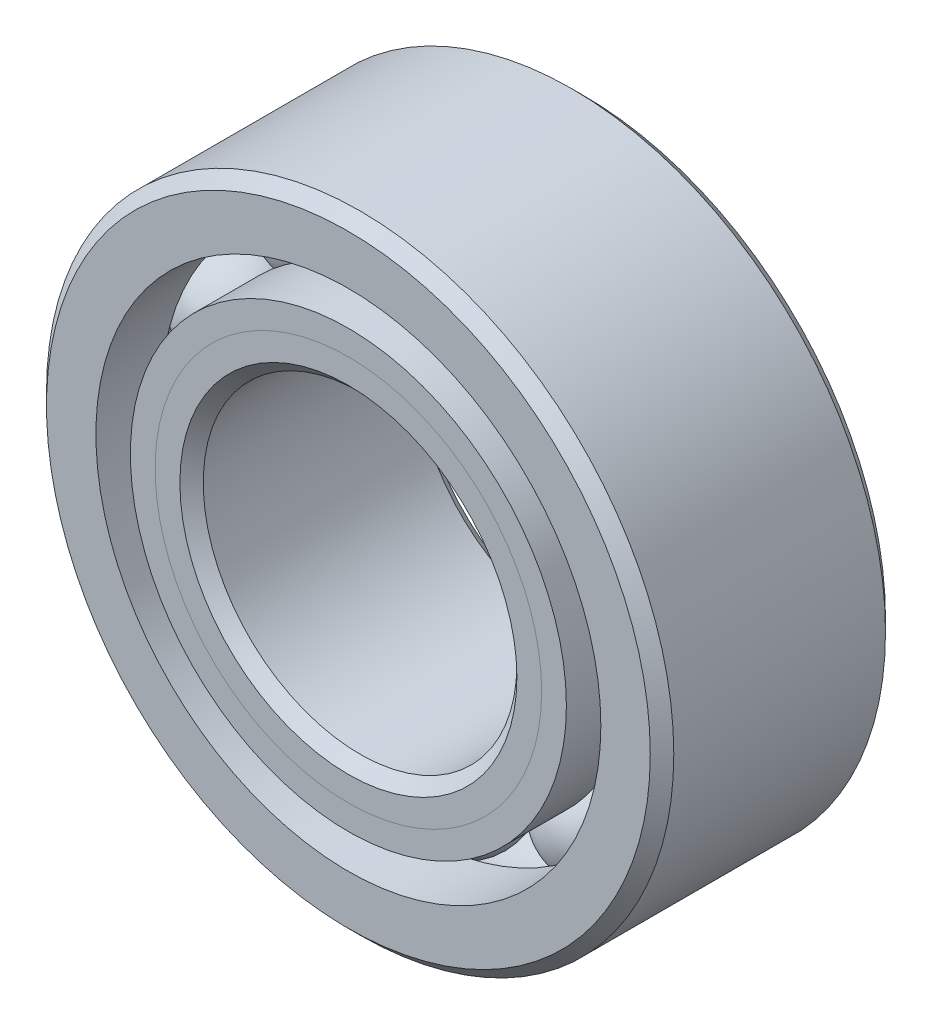
ISO-10303-21;
HEADER;
FILE_DESCRIPTION(('STEP AP214'),'2;1');
FILE_NAME('part.step','',(''),(''),'','','');
FILE_SCHEMA(('AUTOMOTIVE_DESIGN { 1 0 10303 214 1 1 1 1 }'));
ENDSEC;
DATA;
#1=APPLICATION_CONTEXT('core data for automotive mechanical design processes');
#2=APPLICATION_PROTOCOL_DEFINITION('international standard','automotive_design',2000,#1);
#3=PRODUCT_CONTEXT('',#1,'mechanical');
#4=PRODUCT('Part','Part','',(#3));
#5=PRODUCT_RELATED_PRODUCT_CATEGORY('part','',(#4));
#6=PRODUCT_DEFINITION_FORMATION('','',#4);
#7=PRODUCT_DEFINITION_CONTEXT('part definition',#1,'design');
#8=PRODUCT_DEFINITION('design','',#6,#7);
#9=PRODUCT_DEFINITION_SHAPE('','',#8);
#10=(LENGTH_UNIT() NAMED_UNIT(*) SI_UNIT(.MILLI.,.METRE.));
#11=(NAMED_UNIT(*) PLANE_ANGLE_UNIT() SI_UNIT($,.RADIAN.));
#12=(NAMED_UNIT(*) SI_UNIT($,.STERADIAN.) SOLID_ANGLE_UNIT());
#13=UNCERTAINTY_MEASURE_WITH_UNIT(LENGTH_MEASURE(1.E-05),#10,'distance_accuracy_value','');
#14=(GEOMETRIC_REPRESENTATION_CONTEXT(3) GLOBAL_UNCERTAINTY_ASSIGNED_CONTEXT((#13)) GLOBAL_UNIT_ASSIGNED_CONTEXT((#10,
#11,#12)) REPRESENTATION_CONTEXT('',''));
#15=CARTESIAN_POINT('',(0.,0.,0.));
#16=DIRECTION('',(0.,0.,1.));
#17=DIRECTION('',(1.,0.,0.));
#18=AXIS2_PLACEMENT_3D('',#15,#16,#17);
#19=CARTESIAN_POINT('',(-1.39966363202143,1.92647171785536,0.));
#20=DIRECTION('',(0.,0.,1.));
#21=DIRECTION('',(-0.587785252292462,0.809016994374955,0.));
#22=AXIS2_PLACEMENT_3D('',#19,#20,#21);
#23=SPHERICAL_SURFACE('',#22,0.557180720515983);
#24=CARTESIAN_POINT('',(-1.39966363202143,1.92647171785536,0.557180720515982));
#25=VERTEX_POINT('',#24);
#26=VERTEX_LOOP('',#25);
#27=FACE_BOUND('',#26,.T.);
#28=ADVANCED_FACE('F48',(#27),#23,.T.);
#29=CLOSED_SHELL('',(#28));
#30=MANIFOLD_SOLID_BREP('B2',#29);
#31=CARTESIAN_POINT('',(-2.26470332942783,0.735846717855369,0.));
#32=DIRECTION('',(0.,0.,1.));
#33=DIRECTION('',(-0.95105651629515,0.309016994374958,0.));
#34=AXIS2_PLACEMENT_3D('',#31,#32,#33);
#35=SPHERICAL_SURFACE('',#34,0.557180720515983);
#36=CARTESIAN_POINT('',(-2.26470332942783,0.735846717855369,0.557180720515982));
#37=VERTEX_POINT('',#36);
#38=VERTEX_LOOP('',#37);
#39=FACE_BOUND('',#38,.T.);
#40=ADVANCED_FACE('F87',(#39),#35,.T.);
#41=CLOSED_SHELL('',(#40));
#42=MANIFOLD_SOLID_BREP('B6',#41);
#43=CARTESIAN_POINT('',(-2.26470332942784,-0.735846717855322,0.));
#44=DIRECTION('',(0.,0.,1.));
#45=DIRECTION('',(-0.951056516295157,-0.309016994374938,0.));
#46=AXIS2_PLACEMENT_3D('',#43,#44,#45);
#47=SPHERICAL_SURFACE('',#46,0.557180720515983);
#48=CARTESIAN_POINT('',(-2.26470332942784,-0.735846717855322,0.557180720515982));
#49=VERTEX_POINT('',#48);
#50=VERTEX_LOOP('',#49);
#51=FACE_BOUND('',#50,.T.);
#52=ADVANCED_FACE('F126',(#51),#47,.T.);
#53=CLOSED_SHELL('',(#52));
#54=MANIFOLD_SOLID_BREP('B44',#53);
#55=CARTESIAN_POINT('',(-1.39966363202147,-1.92647171785533,0.));
#56=DIRECTION('',(0.,0.,1.));
#57=DIRECTION('',(-0.58778525229248,-0.809016994374942,0.));
#58=AXIS2_PLACEMENT_3D('',#55,#56,#57);
#59=SPHERICAL_SURFACE('',#58,0.557180720515983);
#60=CARTESIAN_POINT('',(-1.39966363202147,-1.92647171785533,0.557180720515982));
#61=VERTEX_POINT('',#60);
#62=VERTEX_LOOP('',#61);
#63=FACE_BOUND('',#62,.T.);
#64=ADVANCED_FACE('F165',(#63),#59,.T.);
#65=CLOSED_SHELL('',(#64));
#66=MANIFOLD_SOLID_BREP('B83',#65);
#67=CARTESIAN_POINT('',(0.,-2.38125,0.));
#68=DIRECTION('',(0.,0.,1.));
#69=DIRECTION('',(0.,-1.,0.));
#70=AXIS2_PLACEMENT_3D('',#67,#68,#69);
#71=SPHERICAL_SURFACE('',#70,0.557180720515983);
#72=CARTESIAN_POINT('',(0.,-2.38125,0.557180720515982));
#73=VERTEX_POINT('',#72);
#74=VERTEX_LOOP('',#73);
#75=FACE_BOUND('',#74,.T.);
#76=ADVANCED_FACE('F206',(#75),#71,.T.);
#77=CLOSED_SHELL('',(#76));
#78=MANIFOLD_SOLID_BREP('B122',#77);
#79=CARTESIAN_POINT('',(1.39966363202144,-1.92647171785535,0.));
#80=DIRECTION('',(0.,0.,1.));
#81=DIRECTION('',(0.587785252292469,-0.809016994374951,0.));
#82=AXIS2_PLACEMENT_3D('',#79,#80,#81);
#83=SPHERICAL_SURFACE('',#82,0.557180720515983);
#84=CARTESIAN_POINT('',(1.39966363202144,-1.92647171785535,0.557180720515982));
#85=VERTEX_POINT('',#84);
#86=VERTEX_LOOP('',#85);
#87=FACE_BOUND('',#86,.T.);
#88=ADVANCED_FACE('F247',(#87),#83,.T.);
#89=CLOSED_SHELL('',(#88));
#90=MANIFOLD_SOLID_BREP('B161',#89);
#91=CARTESIAN_POINT('',(2.26470332942783,-0.735846717855353,0.));
#92=DIRECTION('',(0.,0.,1.));
#93=DIRECTION('',(0.951056516295152,-0.309016994374952,0.));
#94=AXIS2_PLACEMENT_3D('',#91,#92,#93);
#95=SPHERICAL_SURFACE('',#94,0.557180720515983);
#96=CARTESIAN_POINT('',(2.26470332942783,-0.735846717855353,0.557180720515982));
#97=VERTEX_POINT('',#96);
#98=VERTEX_LOOP('',#97);
#99=FACE_BOUND('',#98,.T.);
#100=ADVANCED_FACE('F286',(#99),#95,.T.);
#101=CLOSED_SHELL('',(#100));
#102=MANIFOLD_SOLID_BREP('B202',#101);
#103=CARTESIAN_POINT('',(2.26470332942784,0.735846717855337,0.));
#104=DIRECTION('',(0.,0.,1.));
#105=DIRECTION('',(0.951056516295155,0.309016994374945,0.));
#106=AXIS2_PLACEMENT_3D('',#103,#104,#105);
#107=SPHERICAL_SURFACE('',#106,0.557180720515983);
#108=CARTESIAN_POINT('',(2.26470332942784,0.735846717855337,0.557180720515982));
#109=VERTEX_POINT('',#108);
#110=VERTEX_LOOP('',#109);
#111=FACE_BOUND('',#110,.T.);
#112=ADVANCED_FACE('F325',(#111),#107,.T.);
#113=CLOSED_SHELL('',(#112));
#114=MANIFOLD_SOLID_BREP('B243',#113);
#115=CARTESIAN_POINT('',(1.39966363202145,1.92647171785534,0.));
#116=DIRECTION('',(0.,0.,1.));
#117=DIRECTION('',(0.587785252292474,0.809016994374947,0.));
#118=AXIS2_PLACEMENT_3D('',#115,#116,#117);
#119=SPHERICAL_SURFACE('',#118,0.557180720515983);
#120=CARTESIAN_POINT('',(1.39966363202145,1.92647171785534,0.557180720515982));
#121=VERTEX_POINT('',#120);
#122=VERTEX_LOOP('',#121);
#123=FACE_BOUND('',#122,.T.);
#124=ADVANCED_FACE('F366',(#123),#119,.T.);
#125=CLOSED_SHELL('',(#124));
#126=MANIFOLD_SOLID_BREP('B282',#125);
#127=CARTESIAN_POINT('',(0.,2.38125,0.));
#128=DIRECTION('',(0.,0.,1.));
#129=DIRECTION('',(0.,1.,0.));
#130=AXIS2_PLACEMENT_3D('',#127,#128,#129);
#131=SPHERICAL_SURFACE('',#130,0.557180720515983);
#132=CARTESIAN_POINT('',(0.,2.38125,0.557180720515982));
#133=VERTEX_POINT('',#132);
#134=VERTEX_LOOP('',#133);
#135=FACE_BOUND('',#134,.T.);
#136=ADVANCED_FACE('F409',(#135),#131,.T.);
#137=CLOSED_SHELL('',(#136));
#138=MANIFOLD_SOLID_BREP('B321',#137);
#139=CARTESIAN_POINT('',(0.,1.95629204514573,1.190625));
#140=DIRECTION('',(0.,0.,-1.));
#141=DIRECTION('',(-1.,0.,0.));
#142=AXIS2_PLACEMENT_3D('',#139,#140,#141);
#143=PLANE('',#142);
#144=CARTESIAN_POINT('',(0.,0.,1.190625));
#145=DIRECTION('',(0.,0.,1.));
#146=DIRECTION('',(1.,0.,0.));
#147=AXIS2_PLACEMENT_3D('',#144,#145,#146);
#148=CIRCLE('',#147,1.70578463974201);
#149=CARTESIAN_POINT('',(1.70578463974201,0.,1.190625));
#150=VERTEX_POINT('',#149);
#151=EDGE_CURVE('E464',#150,#150,#148,.T.);
#152=ORIENTED_EDGE('',*,*,#151,.F.);
#153=EDGE_LOOP('',(#152));
#154=FACE_BOUND('',#153,.T.);
#155=CARTESIAN_POINT('',(0.,0.,1.190625));
#156=DIRECTION('',(0.,0.,1.));
#157=DIRECTION('',(1.,0.,0.));
#158=AXIS2_PLACEMENT_3D('',#155,#156,#157);
#159=CIRCLE('',#158,1.95629204514573);
#160=CARTESIAN_POINT('',(1.95629204514573,0.,1.190625));
#161=VERTEX_POINT('',#160);
#162=EDGE_CURVE('E408',#161,#161,#159,.T.);
#163=ORIENTED_EDGE('',*,*,#162,.T.);
#164=EDGE_LOOP('',(#163));
#165=FACE_BOUND('',#164,.T.);
#166=ADVANCED_FACE('F430',(#154,#165),#143,.F.);
#167=CARTESIAN_POINT('',(0.,0.,0.940117594596281));
#168=DIRECTION('',(0.,0.,1.));
#169=DIRECTION('',(1.,0.,0.));
#170=AXIS2_PLACEMENT_3D('',#167,#168,#169);
#171=CONICAL_SURFACE('',#170,1.70578463974201,0.78539816339745);
#172=ORIENTED_EDGE('',*,*,#162,.F.);
#173=EDGE_LOOP('',(#172));
#174=FACE_BOUND('',#173,.T.);
#175=CARTESIAN_POINT('',(0.,0.,0.940117594596281));
#176=DIRECTION('',(0.,0.,1.));
#177=DIRECTION('',(1.,0.,0.));
#178=AXIS2_PLACEMENT_3D('',#175,#176,#177);
#179=CIRCLE('',#178,1.70578463974201);
#180=CARTESIAN_POINT('',(1.70578463974201,0.,0.940117594596281));
#181=VERTEX_POINT('',#180);
#182=EDGE_CURVE('E436',#181,#181,#179,.T.);
#183=ORIENTED_EDGE('',*,*,#182,.T.);
#184=EDGE_LOOP('',(#183));
#185=FACE_BOUND('',#184,.T.);
#186=ADVANCED_FACE('F471',(#174,#185),#171,.T.);
#187=CARTESIAN_POINT('',(0.,0.,1.190625));
#188=DIRECTION('',(0.,0.,1.));
#189=DIRECTION('',(1.,0.,0.));
#190=AXIS2_PLACEMENT_3D('',#187,#188,#189);
#191=CYLINDRICAL_SURFACE('',#190,1.70578463974201);
#192=ORIENTED_EDGE('',*,*,#182,.F.);
#193=EDGE_LOOP('',(#192));
#194=FACE_BOUND('',#193,.T.);
#195=CARTESIAN_POINT('',(0.,0.,0.));
#196=DIRECTION('',(0.,0.,1.));
#197=DIRECTION('',(1.,0.,0.));
#198=AXIS2_PLACEMENT_3D('',#195,#196,#197);
#199=CIRCLE('',#198,1.70578463974201);
#200=CARTESIAN_POINT('',(1.70578463974201,0.,0.));
#201=VERTEX_POINT('',#200);
#202=EDGE_CURVE('E440',#201,#201,#199,.T.);
#203=ORIENTED_EDGE('',*,*,#202,.T.);
#204=EDGE_LOOP('',(#203));
#205=FACE_BOUND('',#204,.T.);
#206=ADVANCED_FACE('F475',(#194,#205),#191,.T.);
#207=CARTESIAN_POINT('',(0.,1.70578463974201,0.));
#208=DIRECTION('',(0.,0.,-1.));
#209=DIRECTION('',(-1.,0.,0.));
#210=AXIS2_PLACEMENT_3D('',#207,#208,#209);
#211=PLANE('',#210);
#212=ORIENTED_EDGE('',*,*,#202,.F.);
#213=EDGE_LOOP('',(#212));
#214=FACE_BOUND('',#213,.T.);
#215=CARTESIAN_POINT('',(0.,0.,0.));
#216=DIRECTION('',(0.,0.,1.));
#217=DIRECTION('',(1.,0.,0.));
#218=AXIS2_PLACEMENT_3D('',#215,#216,#217);
#219=CIRCLE('',#218,1.82406927948402);
#220=CARTESIAN_POINT('',(1.82406927948402,0.,0.));
#221=VERTEX_POINT('',#220);
#222=EDGE_CURVE('E444',#221,#221,#219,.T.);
#223=ORIENTED_EDGE('',*,*,#222,.T.);
#224=EDGE_LOOP('',(#223));
#225=FACE_BOUND('',#224,.T.);
#226=ADVANCED_FACE('F480',(#214,#225),#211,.F.);
#227=CARTESIAN_POINT('',(0.,0.,0.));
#228=DIRECTION('',(0.,0.,1.));
#229=DIRECTION('',(1.,0.,0.));
#230=AXIS2_PLACEMENT_3D('',#227,#228,#229);
#231=TOROIDAL_SURFACE('',#230,2.38125,0.557180720515982);
#232=ORIENTED_EDGE('',*,*,#222,.F.);
#233=EDGE_LOOP('',(#232));
#234=FACE_BOUND('',#233,.T.);
#235=CARTESIAN_POINT('',(0.,0.,-0.529166666666667));
#236=DIRECTION('',(0.,0.,1.));
#237=DIRECTION('',(1.,0.,0.));
#238=AXIS2_PLACEMENT_3D('',#235,#236,#237);
#239=CIRCLE('',#238,2.20679945054945);
#240=CARTESIAN_POINT('',(2.20679945054945,0.,-0.529166666666667));
#241=VERTEX_POINT('',#240);
#242=EDGE_CURVE('E449',#241,#241,#239,.T.);
#243=ORIENTED_EDGE('',*,*,#242,.T.);
#244=EDGE_LOOP('',(#243));
#245=FACE_BOUND('',#244,.T.);
#246=ADVANCED_FACE('F486',(#234,#245),#231,.F.);
#247=CARTESIAN_POINT('',(0.,0.,1.190625));
#248=DIRECTION('',(0.,0.,1.));
#249=DIRECTION('',(1.,0.,0.));
#250=AXIS2_PLACEMENT_3D('',#247,#248,#249);
#251=CYLINDRICAL_SURFACE('',#250,2.20679945054945);
#252=ORIENTED_EDGE('',*,*,#242,.F.);
#253=EDGE_LOOP('',(#252));
#254=FACE_BOUND('',#253,.T.);
#255=CARTESIAN_POINT('',(0.,0.,-1.190625));
#256=DIRECTION('',(0.,0.,1.));
#257=DIRECTION('',(1.,0.,0.));
#258=AXIS2_PLACEMENT_3D('',#255,#256,#257);
#259=CIRCLE('',#258,2.20679945054945);
#260=CARTESIAN_POINT('',(2.20679945054945,0.,-1.190625));
#261=VERTEX_POINT('',#260);
#262=EDGE_CURVE('E452',#261,#261,#259,.T.);
#263=ORIENTED_EDGE('',*,*,#262,.T.);
#264=EDGE_LOOP('',(#263));
#265=FACE_BOUND('',#264,.T.);
#266=ADVANCED_FACE('F490',(#254,#265),#251,.T.);
#267=CARTESIAN_POINT('',(0.,1.7065625,-1.190625));
#268=DIRECTION('',(0.,0.,1.));
#269=DIRECTION('',(1.,0.,0.));
#270=AXIS2_PLACEMENT_3D('',#267,#268,#269);
#271=PLANE('',#270);
#272=ORIENTED_EDGE('',*,*,#262,.F.);
#273=EDGE_LOOP('',(#272));
#274=FACE_BOUND('',#273,.T.);
#275=CARTESIAN_POINT('',(0.,0.,-1.190625));
#276=DIRECTION('',(0.,0.,1.));
#277=DIRECTION('',(1.,0.,0.));
#278=AXIS2_PLACEMENT_3D('',#275,#276,#277);
#279=CIRCLE('',#278,1.7065625);
#280=CARTESIAN_POINT('',(1.7065625,0.,-1.190625));
#281=VERTEX_POINT('',#280);
#282=EDGE_CURVE('E455',#281,#281,#279,.T.);
#283=ORIENTED_EDGE('',*,*,#282,.T.);
#284=EDGE_LOOP('',(#283));
#285=FACE_BOUND('',#284,.T.);
#286=ADVANCED_FACE('F494',(#274,#285),#271,.F.);
#287=CARTESIAN_POINT('',(0.,0.,-1.0715625));
#288=DIRECTION('',(0.,0.,-1.));
#289=DIRECTION('',(-1.,0.,0.));
#290=AXIS2_PLACEMENT_3D('',#287,#288,#289);
#291=CONICAL_SURFACE('',#290,1.5875,0.785398163397448);
#292=ORIENTED_EDGE('',*,*,#282,.F.);
#293=EDGE_LOOP('',(#292));
#294=FACE_BOUND('',#293,.T.);
#295=CARTESIAN_POINT('',(0.,0.,-1.0715625));
#296=DIRECTION('',(0.,0.,1.));
#297=DIRECTION('',(1.,0.,0.));
#298=AXIS2_PLACEMENT_3D('',#295,#296,#297);
#299=CIRCLE('',#298,1.5875);
#300=CARTESIAN_POINT('',(1.5875,0.,-1.0715625));
#301=VERTEX_POINT('',#300);
#302=EDGE_CURVE('E458',#301,#301,#299,.T.);
#303=ORIENTED_EDGE('',*,*,#302,.T.);
#304=EDGE_LOOP('',(#303));
#305=FACE_BOUND('',#304,.T.);
#306=ADVANCED_FACE('F498',(#294,#305),#291,.F.);
#307=CARTESIAN_POINT('',(0.,0.,1.190625));
#308=DIRECTION('',(0.,0.,1.));
#309=DIRECTION('',(1.,0.,0.));
#310=AXIS2_PLACEMENT_3D('',#307,#308,#309);
#311=CYLINDRICAL_SURFACE('',#310,1.5875);
#312=ORIENTED_EDGE('',*,*,#302,.F.);
#313=EDGE_LOOP('',(#312));
#314=FACE_BOUND('',#313,.T.);
#315=CARTESIAN_POINT('',(0.,0.,1.07234036025799));
#316=DIRECTION('',(0.,0.,1.));
#317=DIRECTION('',(1.,0.,0.));
#318=AXIS2_PLACEMENT_3D('',#315,#316,#317);
#319=CIRCLE('',#318,1.5875);
#320=CARTESIAN_POINT('',(1.5875,0.,1.07234036025799));
#321=VERTEX_POINT('',#320);
#322=EDGE_CURVE('E461',#321,#321,#319,.T.);
#323=ORIENTED_EDGE('',*,*,#322,.T.);
#324=EDGE_LOOP('',(#323));
#325=FACE_BOUND('',#324,.T.);
#326=ADVANCED_FACE('F502',(#314,#325),#311,.F.);
#327=CARTESIAN_POINT('',(0.,0.,1.190625));
#328=DIRECTION('',(0.,0.,1.));
#329=DIRECTION('',(1.,0.,0.));
#330=AXIS2_PLACEMENT_3D('',#327,#328,#329);
#331=CONICAL_SURFACE('',#330,1.70578463974201,0.78539816339745);
#332=ORIENTED_EDGE('',*,*,#322,.F.);
#333=EDGE_LOOP('',(#332));
#334=FACE_BOUND('',#333,.T.);
#335=ORIENTED_EDGE('',*,*,#151,.T.);
#336=EDGE_LOOP('',(#335));
#337=FACE_BOUND('',#336,.T.);
#338=ADVANCED_FACE('F468',(#334,#337),#331,.F.);
#339=CLOSED_SHELL('',(#166,#186,#206,#226,#246,#266,#286,#306,#326,#338));
#340=MANIFOLD_SOLID_BREP('B362',#339);
#341=CARTESIAN_POINT('',(0.,2.20679945054945,1.190625));
#342=DIRECTION('',(0.,0.,-1.));
#343=DIRECTION('',(-1.,0.,0.));
#344=AXIS2_PLACEMENT_3D('',#341,#342,#343);
#345=PLANE('',#344);
#346=CARTESIAN_POINT('',(0.,0.,1.190625));
#347=DIRECTION('',(0.,0.,1.));
#348=DIRECTION('',(1.,0.,0.));
#349=AXIS2_PLACEMENT_3D('',#346,#347,#348);
#350=CIRCLE('',#349,1.95629204514573);
#351=CARTESIAN_POINT('',(1.95629204514573,0.,1.190625));
#352=VERTEX_POINT('',#351);
#353=EDGE_CURVE('E429',#352,#352,#350,.T.);
#354=ORIENTED_EDGE('',*,*,#353,.F.);
#355=EDGE_LOOP('',(#354));
#356=FACE_BOUND('',#355,.T.);
#357=CARTESIAN_POINT('',(0.,0.,1.190625));
#358=DIRECTION('',(0.,0.,1.));
#359=DIRECTION('',(1.,0.,0.));
#360=AXIS2_PLACEMENT_3D('',#357,#358,#359);
#361=CIRCLE('',#360,2.20679945054945);
#362=CARTESIAN_POINT('',(2.20679945054945,0.,1.190625));
#363=VERTEX_POINT('',#362);
#364=EDGE_CURVE('E611',#363,#363,#361,.T.);
#365=ORIENTED_EDGE('',*,*,#364,.T.);
#366=EDGE_LOOP('',(#365));
#367=FACE_BOUND('',#366,.T.);
#368=ADVANCED_FACE('F589',(#356,#367),#345,.F.);
#369=CARTESIAN_POINT('',(0.,0.,1.190625));
#370=DIRECTION('',(0.,0.,1.));
#371=DIRECTION('',(1.,0.,0.));
#372=AXIS2_PLACEMENT_3D('',#369,#370,#371);
#373=CONICAL_SURFACE('',#372,1.95629204514573,0.78539816339745);
#374=CARTESIAN_POINT('',(0.,0.,0.940117594596281));
#375=DIRECTION('',(0.,0.,1.));
#376=DIRECTION('',(1.,0.,0.));
#377=AXIS2_PLACEMENT_3D('',#374,#375,#376);
#378=CIRCLE('',#377,1.70578463974201);
#379=CARTESIAN_POINT('',(1.70578463974201,0.,0.940117594596281));
#380=VERTEX_POINT('',#379);
#381=EDGE_CURVE('E595',#380,#380,#378,.T.);
#382=ORIENTED_EDGE('',*,*,#381,.F.);
#383=EDGE_LOOP('',(#382));
#384=FACE_BOUND('',#383,.T.);
#385=ORIENTED_EDGE('',*,*,#353,.T.);
#386=EDGE_LOOP('',(#385));
#387=FACE_BOUND('',#386,.T.);
#388=ADVANCED_FACE('F636',(#384,#387),#373,.F.);
#389=CARTESIAN_POINT('',(0.,0.,1.190625));
#390=DIRECTION('',(0.,0.,1.));
#391=DIRECTION('',(1.,0.,0.));
#392=AXIS2_PLACEMENT_3D('',#389,#390,#391);
#393=CYLINDRICAL_SURFACE('',#392,1.70578463974201);
#394=CARTESIAN_POINT('',(0.,0.,0.));
#395=DIRECTION('',(0.,0.,1.));
#396=DIRECTION('',(1.,0.,0.));
#397=AXIS2_PLACEMENT_3D('',#394,#395,#396);
#398=CIRCLE('',#397,1.70578463974201);
#399=CARTESIAN_POINT('',(1.70578463974201,0.,0.));
#400=VERTEX_POINT('',#399);
#401=EDGE_CURVE('E599',#400,#400,#398,.T.);
#402=ORIENTED_EDGE('',*,*,#401,.F.);
#403=EDGE_LOOP('',(#402));
#404=FACE_BOUND('',#403,.T.);
#405=ORIENTED_EDGE('',*,*,#381,.T.);
#406=EDGE_LOOP('',(#405));
#407=FACE_BOUND('',#406,.T.);
#408=ADVANCED_FACE('F631',(#404,#407),#393,.F.);
#409=CARTESIAN_POINT('',(0.,1.70578463974201,0.));
#410=DIRECTION('',(0.,0.,1.));
#411=DIRECTION('',(1.,0.,0.));
#412=AXIS2_PLACEMENT_3D('',#409,#410,#411);
#413=PLANE('',#412);
#414=CARTESIAN_POINT('',(0.,0.,0.));
#415=DIRECTION('',(0.,0.,1.));
#416=DIRECTION('',(1.,0.,0.));
#417=AXIS2_PLACEMENT_3D('',#414,#415,#416);
#418=CIRCLE('',#417,1.82406927948402);
#419=CARTESIAN_POINT('',(1.82406927948402,0.,0.));
#420=VERTEX_POINT('',#419);
#421=EDGE_CURVE('E603',#420,#420,#418,.T.);
#422=ORIENTED_EDGE('',*,*,#421,.F.);
#423=EDGE_LOOP('',(#422));
#424=FACE_BOUND('',#423,.T.);
#425=ORIENTED_EDGE('',*,*,#401,.T.);
#426=EDGE_LOOP('',(#425));
#427=FACE_BOUND('',#426,.T.);
#428=ADVANCED_FACE('F625',(#424,#427),#413,.F.);
#429=CARTESIAN_POINT('',(0.,0.,0.));
#430=DIRECTION('',(0.,0.,1.));
#431=DIRECTION('',(1.,0.,0.));
#432=AXIS2_PLACEMENT_3D('',#429,#430,#431);
#433=TOROIDAL_SURFACE('',#432,2.38125,0.557180720515983);
#434=CARTESIAN_POINT('',(0.,0.,0.529166666666666));
#435=DIRECTION('',(0.,0.,1.));
#436=DIRECTION('',(1.,0.,0.));
#437=AXIS2_PLACEMENT_3D('',#434,#435,#436);
#438=CIRCLE('',#437,2.20679945054945);
#439=CARTESIAN_POINT('',(2.20679945054945,0.,0.529166666666666));
#440=VERTEX_POINT('',#439);
#441=EDGE_CURVE('E608',#440,#440,#438,.T.);
#442=ORIENTED_EDGE('',*,*,#441,.F.);
#443=EDGE_LOOP('',(#442));
#444=FACE_BOUND('',#443,.T.);
#445=ORIENTED_EDGE('',*,*,#421,.T.);
#446=EDGE_LOOP('',(#445));
#447=FACE_BOUND('',#446,.T.);
#448=ADVANCED_FACE('F619',(#444,#447),#433,.F.);
#449=CARTESIAN_POINT('',(0.,0.,1.190625));
#450=DIRECTION('',(0.,0.,1.));
#451=DIRECTION('',(1.,0.,0.));
#452=AXIS2_PLACEMENT_3D('',#449,#450,#451);
#453=CYLINDRICAL_SURFACE('',#452,2.20679945054945);
#454=ORIENTED_EDGE('',*,*,#364,.F.);
#455=EDGE_LOOP('',(#454));
#456=FACE_BOUND('',#455,.T.);
#457=ORIENTED_EDGE('',*,*,#441,.T.);
#458=EDGE_LOOP('',(#457));
#459=FACE_BOUND('',#458,.T.);
#460=ADVANCED_FACE('F616',(#456,#459),#453,.T.);
#461=CLOSED_SHELL('',(#368,#388,#408,#428,#448,#460));
#462=MANIFOLD_SOLID_BREP('B403',#461);
#463=CARTESIAN_POINT('',(0.,0.,1.0715625));
#464=DIRECTION('',(0.,0.,-1.));
#465=DIRECTION('',(-1.,0.,0.));
#466=AXIS2_PLACEMENT_3D('',#463,#464,#465);
#467=CONICAL_SURFACE('',#466,3.175,0.785398163397449);
#468=CARTESIAN_POINT('',(0.,0.,1.190625));
#469=DIRECTION('',(0.,0.,1.));
#470=DIRECTION('',(1.,0.,0.));
#471=AXIS2_PLACEMENT_3D('',#468,#469,#470);
#472=CIRCLE('',#471,3.0559375);
#473=CARTESIAN_POINT('',(3.0559375,0.,1.190625));
#474=VERTEX_POINT('',#473);
#475=EDGE_CURVE('E709',#474,#474,#472,.T.);
#476=ORIENTED_EDGE('',*,*,#475,.F.);
#477=EDGE_LOOP('',(#476));
#478=FACE_BOUND('',#477,.T.);
#479=CARTESIAN_POINT('',(0.,0.,1.0715625));
#480=DIRECTION('',(0.,0.,1.));
#481=DIRECTION('',(1.,0.,0.));
#482=AXIS2_PLACEMENT_3D('',#479,#480,#481);
#483=CIRCLE('',#482,3.175);
#484=CARTESIAN_POINT('',(3.175,0.,1.0715625));
#485=VERTEX_POINT('',#484);
#486=EDGE_CURVE('E588',#485,#485,#483,.T.);
#487=ORIENTED_EDGE('',*,*,#486,.T.);
#488=EDGE_LOOP('',(#487));
#489=FACE_BOUND('',#488,.T.);
#490=ADVANCED_FACE('F681',(#478,#489),#467,.T.);
#491=CARTESIAN_POINT('',(0.,0.,1.190625));
#492=DIRECTION('',(0.,0.,1.));
#493=DIRECTION('',(1.,0.,0.));
#494=AXIS2_PLACEMENT_3D('',#491,#492,#493);
#495=CYLINDRICAL_SURFACE('',#494,3.175);
#496=ORIENTED_EDGE('',*,*,#486,.F.);
#497=EDGE_LOOP('',(#496));
#498=FACE_BOUND('',#497,.T.);
#499=CARTESIAN_POINT('',(0.,0.,-1.0715625));
#500=DIRECTION('',(0.,0.,1.));
#501=DIRECTION('',(1.,0.,0.));
#502=AXIS2_PLACEMENT_3D('',#499,#500,#501);
#503=CIRCLE('',#502,3.175);
#504=CARTESIAN_POINT('',(3.175,0.,-1.0715625));
#505=VERTEX_POINT('',#504);
#506=EDGE_CURVE('E687',#505,#505,#503,.T.);
#507=ORIENTED_EDGE('',*,*,#506,.T.);
#508=EDGE_LOOP('',(#507));
#509=FACE_BOUND('',#508,.T.);
#510=ADVANCED_FACE('F716',(#498,#509),#495,.T.);
#511=CARTESIAN_POINT('',(0.,0.,-1.190625));
#512=DIRECTION('',(0.,0.,1.));
#513=DIRECTION('',(1.,0.,0.));
#514=AXIS2_PLACEMENT_3D('',#511,#512,#513);
#515=CONICAL_SURFACE('',#514,3.0559375,0.785398163397448);
#516=ORIENTED_EDGE('',*,*,#506,.F.);
#517=EDGE_LOOP('',(#516));
#518=FACE_BOUND('',#517,.T.);
#519=CARTESIAN_POINT('',(0.,0.,-1.190625));
#520=DIRECTION('',(0.,0.,1.));
#521=DIRECTION('',(1.,0.,0.));
#522=AXIS2_PLACEMENT_3D('',#519,#520,#521);
#523=CIRCLE('',#522,3.0559375);
#524=CARTESIAN_POINT('',(3.0559375,0.,-1.190625));
#525=VERTEX_POINT('',#524);
#526=EDGE_CURVE('E691',#525,#525,#523,.T.);
#527=ORIENTED_EDGE('',*,*,#526,.T.);
#528=EDGE_LOOP('',(#527));
#529=FACE_BOUND('',#528,.T.);
#530=ADVANCED_FACE('F720',(#518,#529),#515,.T.);
#531=CARTESIAN_POINT('',(0.,3.0559375,-1.190625));
#532=DIRECTION('',(0.,0.,1.));
#533=DIRECTION('',(1.,0.,0.));
#534=AXIS2_PLACEMENT_3D('',#531,#532,#533);
#535=PLANE('',#534);
#536=ORIENTED_EDGE('',*,*,#526,.F.);
#537=EDGE_LOOP('',(#536));
#538=FACE_BOUND('',#537,.T.);
#539=CARTESIAN_POINT('',(0.,0.,-1.190625));
#540=DIRECTION('',(0.,0.,1.));
#541=DIRECTION('',(1.,0.,0.));
#542=AXIS2_PLACEMENT_3D('',#539,#540,#541);
#543=CIRCLE('',#542,2.55570054945055);
#544=CARTESIAN_POINT('',(2.55570054945055,0.,-1.190625));
#545=VERTEX_POINT('',#544);
#546=EDGE_CURVE('E695',#545,#545,#543,.T.);
#547=ORIENTED_EDGE('',*,*,#546,.T.);
#548=EDGE_LOOP('',(#547));
#549=FACE_BOUND('',#548,.T.);
#550=ADVANCED_FACE('F725',(#538,#549),#535,.F.);
#551=CARTESIAN_POINT('',(0.,0.,1.190625));
#552=DIRECTION('',(0.,0.,1.));
#553=DIRECTION('',(1.,0.,0.));
#554=AXIS2_PLACEMENT_3D('',#551,#552,#553);
#555=CYLINDRICAL_SURFACE('',#554,2.55570054945055);
#556=ORIENTED_EDGE('',*,*,#546,.F.);
#557=EDGE_LOOP('',(#556));
#558=FACE_BOUND('',#557,.T.);
#559=CARTESIAN_POINT('',(0.,0.,-0.529166666666667));
#560=DIRECTION('',(0.,0.,1.));
#561=DIRECTION('',(1.,0.,0.));
#562=AXIS2_PLACEMENT_3D('',#559,#560,#561);
#563=CIRCLE('',#562,2.55570054945055);
#564=CARTESIAN_POINT('',(2.55570054945055,0.,-0.529166666666667));
#565=VERTEX_POINT('',#564);
#566=EDGE_CURVE('E700',#565,#565,#563,.T.);
#567=ORIENTED_EDGE('',*,*,#566,.T.);
#568=EDGE_LOOP('',(#567));
#569=FACE_BOUND('',#568,.T.);
#570=ADVANCED_FACE('F731',(#558,#569),#555,.F.);
#571=CARTESIAN_POINT('',(0.,0.,0.));
#572=DIRECTION('',(0.,0.,1.));
#573=DIRECTION('',(1.,0.,0.));
#574=AXIS2_PLACEMENT_3D('',#571,#572,#573);
#575=TOROIDAL_SURFACE('',#574,2.38125,0.557180720515983);
#576=ORIENTED_EDGE('',*,*,#566,.F.);
#577=EDGE_LOOP('',(#576));
#578=FACE_BOUND('',#577,.T.);
#579=CARTESIAN_POINT('',(0.,0.,0.529166666666666));
#580=DIRECTION('',(0.,0.,1.));
#581=DIRECTION('',(1.,0.,0.));
#582=AXIS2_PLACEMENT_3D('',#579,#580,#581);
#583=CIRCLE('',#582,2.55570054945055);
#584=CARTESIAN_POINT('',(2.55570054945055,0.,0.529166666666666));
#585=VERTEX_POINT('',#584);
#586=EDGE_CURVE('E703',#585,#585,#583,.T.);
#587=ORIENTED_EDGE('',*,*,#586,.T.);
#588=EDGE_LOOP('',(#587));
#589=FACE_BOUND('',#588,.T.);
#590=ADVANCED_FACE('F735',(#578,#589),#575,.F.);
#591=CARTESIAN_POINT('',(0.,0.,1.190625));
#592=DIRECTION('',(0.,0.,1.));
#593=DIRECTION('',(1.,0.,0.));
#594=AXIS2_PLACEMENT_3D('',#591,#592,#593);
#595=CYLINDRICAL_SURFACE('',#594,2.55570054945055);
#596=ORIENTED_EDGE('',*,*,#586,.F.);
#597=EDGE_LOOP('',(#596));
#598=FACE_BOUND('',#597,.T.);
#599=CARTESIAN_POINT('',(0.,0.,1.190625));
#600=DIRECTION('',(0.,0.,1.));
#601=DIRECTION('',(1.,0.,0.));
#602=AXIS2_PLACEMENT_3D('',#599,#600,#601);
#603=CIRCLE('',#602,2.55570054945055);
#604=CARTESIAN_POINT('',(2.55570054945055,0.,1.190625));
#605=VERTEX_POINT('',#604);
#606=EDGE_CURVE('E706',#605,#605,#603,.T.);
#607=ORIENTED_EDGE('',*,*,#606,.T.);
#608=EDGE_LOOP('',(#607));
#609=FACE_BOUND('',#608,.T.);
#610=ADVANCED_FACE('F739',(#598,#609),#595,.F.);
#611=CARTESIAN_POINT('',(0.,3.0559375,1.190625));
#612=DIRECTION('',(0.,0.,-1.));
#613=DIRECTION('',(-1.,0.,0.));
#614=AXIS2_PLACEMENT_3D('',#611,#612,#613);
#615=PLANE('',#614);
#616=ORIENTED_EDGE('',*,*,#606,.F.);
#617=EDGE_LOOP('',(#616));
#618=FACE_BOUND('',#617,.T.);
#619=ORIENTED_EDGE('',*,*,#475,.T.);
#620=EDGE_LOOP('',(#619));
#621=FACE_BOUND('',#620,.T.);
#622=ADVANCED_FACE('F713',(#618,#621),#615,.F.);
#623=CLOSED_SHELL('',(#490,#510,#530,#550,#570,#590,#610,#622));
#624=MANIFOLD_SOLID_BREP('B424',#623);
#625=ADVANCED_BREP_SHAPE_REPRESENTATION('',(#18,#30,#42,#54,#66,#78,#90,#102,#114,#126,#138,
#340,#462,#624),#14);
#626=SHAPE_DEFINITION_REPRESENTATION(#9,#625);
ENDSEC;
END-ISO-10303-21;
